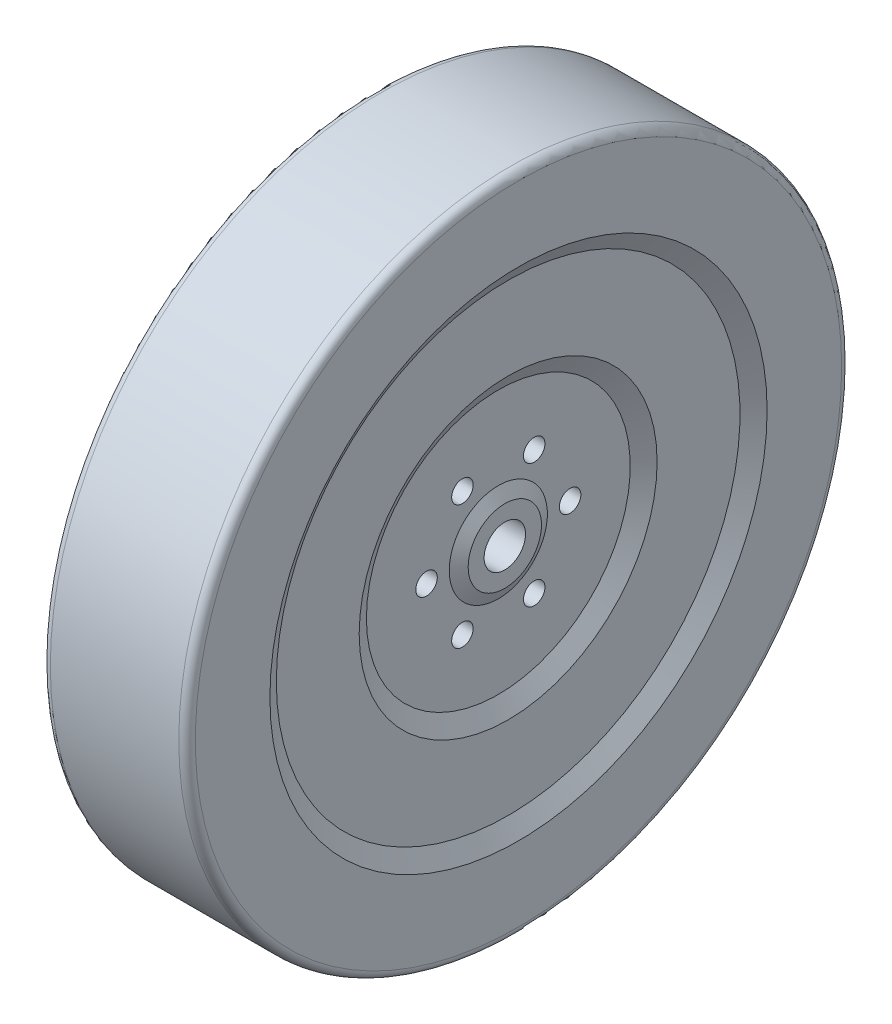
ISO-10303-21;
HEADER;
FILE_DESCRIPTION(('STEP AP214'),'2;1');
FILE_NAME('part.step','',(''),(''),'','','');
FILE_SCHEMA(('AUTOMOTIVE_DESIGN { 1 0 10303 214 1 1 1 1 }'));
ENDSEC;
DATA;
#1=APPLICATION_CONTEXT('core data for automotive mechanical design processes');
#2=APPLICATION_PROTOCOL_DEFINITION('international standard','automotive_design',2000,#1);
#3=PRODUCT_CONTEXT('',#1,'mechanical');
#4=PRODUCT('Part','Part','',(#3));
#5=PRODUCT_RELATED_PRODUCT_CATEGORY('part','',(#4));
#6=PRODUCT_DEFINITION_FORMATION('','',#4);
#7=PRODUCT_DEFINITION_CONTEXT('part definition',#1,'design');
#8=PRODUCT_DEFINITION('design','',#6,#7);
#9=PRODUCT_DEFINITION_SHAPE('','',#8);
#10=(LENGTH_UNIT() NAMED_UNIT(*) SI_UNIT(.MILLI.,.METRE.));
#11=(NAMED_UNIT(*) PLANE_ANGLE_UNIT() SI_UNIT($,.RADIAN.));
#12=(NAMED_UNIT(*) SI_UNIT($,.STERADIAN.) SOLID_ANGLE_UNIT());
#13=UNCERTAINTY_MEASURE_WITH_UNIT(LENGTH_MEASURE(1.E-05),#10,'distance_accuracy_value','');
#14=(GEOMETRIC_REPRESENTATION_CONTEXT(3) GLOBAL_UNCERTAINTY_ASSIGNED_CONTEXT((#13)) GLOBAL_UNIT_ASSIGNED_CONTEXT((#10,
#11,#12)) REPRESENTATION_CONTEXT('',''));
#15=CARTESIAN_POINT('',(0.,0.,0.));
#16=DIRECTION('',(0.,0.,1.));
#17=DIRECTION('',(1.,0.,0.));
#18=AXIS2_PLACEMENT_3D('',#15,#16,#17);
#19=CARTESIAN_POINT('',(0.,0.,0.));
#20=DIRECTION('',(-1.,0.,0.));
#21=DIRECTION('',(0.,0.,1.));
#22=AXIS2_PLACEMENT_3D('',#19,#20,#21);
#23=CYLINDRICAL_SURFACE('',#22,101.6);
#24=CARTESIAN_POINT('',(-19.685,0.,0.));
#25=DIRECTION('',(-1.,0.,0.));
#26=DIRECTION('',(0.,0.,1.));
#27=AXIS2_PLACEMENT_3D('',#24,#25,#26);
#28=CIRCLE('',#27,101.6);
#29=CARTESIAN_POINT('',(-19.685,0.,101.6));
#30=VERTEX_POINT('',#29);
#31=EDGE_CURVE('E40',#30,#30,#28,.F.);
#32=ORIENTED_EDGE('',*,*,#31,.T.);
#33=EDGE_LOOP('',(#32));
#34=FACE_BOUND('',#33,.T.);
#35=CARTESIAN_POINT('',(19.685,0.,0.));
#36=DIRECTION('',(1.,0.,0.));
#37=DIRECTION('',(0.,0.,-1.));
#38=AXIS2_PLACEMENT_3D('',#35,#36,#37);
#39=CIRCLE('',#38,101.6);
#40=CARTESIAN_POINT('',(19.685,0.,-101.6));
#41=VERTEX_POINT('',#40);
#42=EDGE_CURVE('E44',#41,#41,#39,.F.);
#43=ORIENTED_EDGE('',*,*,#42,.T.);
#44=EDGE_LOOP('',(#43));
#45=FACE_BOUND('',#44,.T.);
#46=ADVANCED_FACE('F33',(#34,#45),#23,.T.);
#47=CARTESIAN_POINT('',(-22.225,0.,101.6));
#48=DIRECTION('',(-1.,0.,0.));
#49=DIRECTION('',(0.,0.,1.));
#50=AXIS2_PLACEMENT_3D('',#47,#48,#49);
#51=PLANE('',#50);
#52=CARTESIAN_POINT('',(-22.225,0.,0.));
#53=DIRECTION('',(-1.,0.,0.));
#54=DIRECTION('',(0.,0.,1.));
#55=AXIS2_PLACEMENT_3D('',#52,#53,#54);
#56=CIRCLE('',#55,99.06);
#57=CARTESIAN_POINT('',(-22.225,0.,99.06));
#58=VERTEX_POINT('',#57);
#59=EDGE_CURVE('E48',#58,#58,#56,.T.);
#60=ORIENTED_EDGE('',*,*,#59,.T.);
#61=EDGE_LOOP('',(#60));
#62=FACE_BOUND('',#61,.T.);
#63=CARTESIAN_POINT('',(-22.225,0.,0.));
#64=DIRECTION('',(-1.,0.,0.));
#65=DIRECTION('',(0.,0.,1.));
#66=AXIS2_PLACEMENT_3D('',#63,#64,#65);
#67=CIRCLE('',#66,76.2);
#68=CARTESIAN_POINT('',(-22.225,0.,76.2));
#69=VERTEX_POINT('',#68);
#70=EDGE_CURVE('E53',#69,#69,#67,.T.);
#71=ORIENTED_EDGE('',*,*,#70,.F.);
#72=EDGE_LOOP('',(#71));
#73=FACE_BOUND('',#72,.T.);
#74=ADVANCED_FACE('F184',(#62,#73),#51,.T.);
#75=CARTESIAN_POINT('',(-19.05,0.,0.));
#76=DIRECTION('',(-1.,0.,0.));
#77=DIRECTION('',(0.,0.,1.));
#78=AXIS2_PLACEMENT_3D('',#75,#76,#77);
#79=CONICAL_SURFACE('',#78,71.0633652356277,1.01716771608131);
#80=ORIENTED_EDGE('',*,*,#70,.T.);
#81=EDGE_LOOP('',(#80));
#82=FACE_BOUND('',#81,.T.);
#83=CARTESIAN_POINT('',(-19.05,0.,0.));
#84=DIRECTION('',(-1.,0.,0.));
#85=DIRECTION('',(0.,0.,1.));
#86=AXIS2_PLACEMENT_3D('',#83,#84,#85);
#87=CIRCLE('',#86,71.0633652356277);
#88=CARTESIAN_POINT('',(-19.05,0.,71.0633652356277));
#89=VERTEX_POINT('',#88);
#90=EDGE_CURVE('E56',#89,#89,#87,.T.);
#91=ORIENTED_EDGE('',*,*,#90,.F.);
#92=EDGE_LOOP('',(#91));
#93=FACE_BOUND('',#92,.T.);
#94=ADVANCED_FACE('F189',(#82,#93),#79,.F.);
#95=CARTESIAN_POINT('',(-19.05,0.,71.0633652356277));
#96=DIRECTION('',(-1.,0.,0.));
#97=DIRECTION('',(0.,0.,1.));
#98=AXIS2_PLACEMENT_3D('',#95,#96,#97);
#99=PLANE('',#98);
#100=ORIENTED_EDGE('',*,*,#90,.T.);
#101=EDGE_LOOP('',(#100));
#102=FACE_BOUND('',#101,.T.);
#103=CARTESIAN_POINT('',(-19.05,0.,0.));
#104=DIRECTION('',(-1.,0.,0.));
#105=DIRECTION('',(0.,0.,1.));
#106=AXIS2_PLACEMENT_3D('',#103,#104,#105);
#107=CIRCLE('',#106,45.6633652356277);
#108=CARTESIAN_POINT('',(-19.05,0.,45.6633652356277));
#109=VERTEX_POINT('',#108);
#110=EDGE_CURVE('E59',#109,#109,#107,.T.);
#111=ORIENTED_EDGE('',*,*,#110,.F.);
#112=EDGE_LOOP('',(#111));
#113=FACE_BOUND('',#112,.T.);
#114=ADVANCED_FACE('F211',(#102,#113),#99,.T.);
#115=CARTESIAN_POINT('',(-16.034,0.,0.));
#116=DIRECTION('',(-1.,0.,0.));
#117=DIRECTION('',(0.,0.,1.));
#118=AXIS2_PLACEMENT_3D('',#115,#116,#117);
#119=CONICAL_SURFACE('',#118,40.4395,1.0471975511966);
#120=ORIENTED_EDGE('',*,*,#110,.T.);
#121=EDGE_LOOP('',(#120));
#122=FACE_BOUND('',#121,.T.);
#123=CARTESIAN_POINT('',(-16.034,0.,0.));
#124=DIRECTION('',(-1.,0.,0.));
#125=DIRECTION('',(0.,0.,1.));
#126=AXIS2_PLACEMENT_3D('',#123,#124,#125);
#127=CIRCLE('',#126,40.4395);
#128=CARTESIAN_POINT('',(-16.034,0.,40.4395));
#129=VERTEX_POINT('',#128);
#130=EDGE_CURVE('E62',#129,#129,#127,.T.);
#131=ORIENTED_EDGE('',*,*,#130,.F.);
#132=EDGE_LOOP('',(#131));
#133=FACE_BOUND('',#132,.T.);
#134=ADVANCED_FACE('F216',(#122,#133),#119,.F.);
#135=CARTESIAN_POINT('',(-16.034,0.,40.4395));
#136=DIRECTION('',(-1.,0.,0.));
#137=DIRECTION('',(0.,0.,1.));
#138=AXIS2_PLACEMENT_3D('',#135,#136,#137);
#139=PLANE('',#138);
#140=CARTESIAN_POINT('',(-16.034,0.,-22.));
#141=DIRECTION('',(-1.,0.,0.));
#142=DIRECTION('',(0.,0.,1.));
#143=AXIS2_PLACEMENT_3D('',#140,#141,#142);
#144=CIRCLE('',#143,3.3);
#145=CARTESIAN_POINT('',(-16.034,0.,-18.7));
#146=VERTEX_POINT('',#145);
#147=EDGE_CURVE('E95',#146,#146,#144,.T.);
#148=ORIENTED_EDGE('',*,*,#147,.F.);
#149=EDGE_LOOP('',(#148));
#150=FACE_BOUND('',#149,.T.);
#151=CARTESIAN_POINT('',(-16.034,19.0525588832575,-11.0000000000002));
#152=DIRECTION('',(-1.,0.,0.));
#153=DIRECTION('',(0.,0.,1.));
#154=AXIS2_PLACEMENT_3D('',#151,#152,#153);
#155=CIRCLE('',#154,3.3);
#156=CARTESIAN_POINT('',(-16.034,19.0525588832575,-7.70000000000022));
#157=VERTEX_POINT('',#156);
#158=EDGE_CURVE('E98',#157,#157,#155,.T.);
#159=ORIENTED_EDGE('',*,*,#158,.F.);
#160=EDGE_LOOP('',(#159));
#161=FACE_BOUND('',#160,.T.);
#162=CARTESIAN_POINT('',(-16.034,19.0525588832577,10.9999999999998));
#163=DIRECTION('',(-1.,0.,0.));
#164=DIRECTION('',(0.,0.,1.));
#165=AXIS2_PLACEMENT_3D('',#162,#163,#164);
#166=CIRCLE('',#165,3.3);
#167=CARTESIAN_POINT('',(-16.034,19.0525588832577,14.2999999999998));
#168=VERTEX_POINT('',#167);
#169=EDGE_CURVE('E101',#168,#168,#166,.T.);
#170=ORIENTED_EDGE('',*,*,#169,.F.);
#171=EDGE_LOOP('',(#170));
#172=FACE_BOUND('',#171,.T.);
#173=CARTESIAN_POINT('',(-16.034,1.53625178909098E-13,22.));
#174=DIRECTION('',(-1.,0.,0.));
#175=DIRECTION('',(0.,0.,1.));
#176=AXIS2_PLACEMENT_3D('',#173,#174,#175);
#177=CIRCLE('',#176,3.3);
#178=CARTESIAN_POINT('',(-16.034,1.53625178909098E-13,25.3));
#179=VERTEX_POINT('',#178);
#180=EDGE_CURVE('E104',#179,#179,#177,.T.);
#181=ORIENTED_EDGE('',*,*,#180,.F.);
#182=EDGE_LOOP('',(#181));
#183=FACE_BOUND('',#182,.T.);
#184=CARTESIAN_POINT('',(-16.034,-19.0525588832576,11.0000000000001));
#185=DIRECTION('',(-1.,0.,0.));
#186=DIRECTION('',(0.,0.,1.));
#187=AXIS2_PLACEMENT_3D('',#184,#185,#186);
#188=CIRCLE('',#187,3.3);
#189=CARTESIAN_POINT('',(-16.034,-19.0525588832576,14.3000000000001));
#190=VERTEX_POINT('',#189);
#191=EDGE_CURVE('E107',#190,#190,#188,.T.);
#192=ORIENTED_EDGE('',*,*,#191,.F.);
#193=EDGE_LOOP('',(#192));
#194=FACE_BOUND('',#193,.T.);
#195=CARTESIAN_POINT('',(-16.034,-19.0525588832577,-11.));
#196=DIRECTION('',(-1.,0.,0.));
#197=DIRECTION('',(0.,0.,1.));
#198=AXIS2_PLACEMENT_3D('',#195,#196,#197);
#199=CIRCLE('',#198,3.3);
#200=CARTESIAN_POINT('',(-16.034,-19.0525588832577,-7.69999999999995));
#201=VERTEX_POINT('',#200);
#202=EDGE_CURVE('E110',#201,#201,#199,.T.);
#203=ORIENTED_EDGE('',*,*,#202,.F.);
#204=EDGE_LOOP('',(#203));
#205=FACE_BOUND('',#204,.T.);
#206=ORIENTED_EDGE('',*,*,#130,.T.);
#207=EDGE_LOOP('',(#206));
#208=FACE_BOUND('',#207,.T.);
#209=CARTESIAN_POINT('',(-16.034,0.,0.));
#210=DIRECTION('',(-1.,0.,0.));
#211=DIRECTION('',(0.,0.,1.));
#212=AXIS2_PLACEMENT_3D('',#209,#210,#211);
#213=CIRCLE('',#212,15.0395);
#214=CARTESIAN_POINT('',(-16.034,0.,15.0395));
#215=VERTEX_POINT('',#214);
#216=EDGE_CURVE('E65',#215,#215,#213,.T.);
#217=ORIENTED_EDGE('',*,*,#216,.F.);
#218=EDGE_LOOP('',(#217));
#219=FACE_BOUND('',#218,.T.);
#220=ADVANCED_FACE('F222',(#150,#161,#172,#183,#194,#205,#208,#219),#139,.T.);
#221=CARTESIAN_POINT('',(-18.034,0.,0.));
#222=DIRECTION('',(1.,0.,0.));
#223=DIRECTION('',(0.,0.,-1.));
#224=AXIS2_PLACEMENT_3D('',#221,#222,#223);
#225=CONICAL_SURFACE('',#224,11.2395,1.08631839775787);
#226=ORIENTED_EDGE('',*,*,#216,.T.);
#227=EDGE_LOOP('',(#226));
#228=FACE_BOUND('',#227,.T.);
#229=CARTESIAN_POINT('',(-18.034,0.,0.));
#230=DIRECTION('',(-1.,0.,0.));
#231=DIRECTION('',(0.,0.,1.));
#232=AXIS2_PLACEMENT_3D('',#229,#230,#231);
#233=CIRCLE('',#232,11.2395);
#234=CARTESIAN_POINT('',(-18.034,0.,11.2395));
#235=VERTEX_POINT('',#234);
#236=EDGE_CURVE('E68',#235,#235,#233,.T.);
#237=ORIENTED_EDGE('',*,*,#236,.F.);
#238=EDGE_LOOP('',(#237));
#239=FACE_BOUND('',#238,.T.);
#240=ADVANCED_FACE('F228',(#228,#239),#225,.T.);
#241=CARTESIAN_POINT('',(-18.034,0.,11.2395));
#242=DIRECTION('',(-1.,0.,0.));
#243=DIRECTION('',(0.,0.,1.));
#244=AXIS2_PLACEMENT_3D('',#241,#242,#243);
#245=PLANE('',#244);
#246=ORIENTED_EDGE('',*,*,#236,.T.);
#247=EDGE_LOOP('',(#246));
#248=FACE_BOUND('',#247,.T.);
#249=CARTESIAN_POINT('',(-18.034,0.,0.));
#250=DIRECTION('',(-1.,0.,0.));
#251=DIRECTION('',(0.,0.,1.));
#252=AXIS2_PLACEMENT_3D('',#249,#250,#251);
#253=CIRCLE('',#252,6.35);
#254=CARTESIAN_POINT('',(-18.034,0.,6.35));
#255=VERTEX_POINT('',#254);
#256=EDGE_CURVE('E71',#255,#255,#253,.T.);
#257=ORIENTED_EDGE('',*,*,#256,.F.);
#258=EDGE_LOOP('',(#257));
#259=FACE_BOUND('',#258,.T.);
#260=ADVANCED_FACE('F235',(#248,#259),#245,.T.);
#261=CARTESIAN_POINT('',(0.,0.,0.));
#262=DIRECTION('',(-1.,0.,0.));
#263=DIRECTION('',(0.,0.,1.));
#264=AXIS2_PLACEMENT_3D('',#261,#262,#263);
#265=CYLINDRICAL_SURFACE('',#264,6.35);
#266=ORIENTED_EDGE('',*,*,#256,.T.);
#267=EDGE_LOOP('',(#266));
#268=FACE_BOUND('',#267,.T.);
#269=CARTESIAN_POINT('',(18.034,0.,0.));
#270=DIRECTION('',(-1.,0.,0.));
#271=DIRECTION('',(0.,0.,1.));
#272=AXIS2_PLACEMENT_3D('',#269,#270,#271);
#273=CIRCLE('',#272,6.35);
#274=CARTESIAN_POINT('',(18.034,0.,6.35));
#275=VERTEX_POINT('',#274);
#276=EDGE_CURVE('E74',#275,#275,#273,.T.);
#277=ORIENTED_EDGE('',*,*,#276,.F.);
#278=EDGE_LOOP('',(#277));
#279=FACE_BOUND('',#278,.T.);
#280=ADVANCED_FACE('F241',(#268,#279),#265,.F.);
#281=CARTESIAN_POINT('',(18.034,0.,11.2395));
#282=DIRECTION('',(1.,0.,0.));
#283=DIRECTION('',(0.,0.,-1.));
#284=AXIS2_PLACEMENT_3D('',#281,#282,#283);
#285=PLANE('',#284);
#286=ORIENTED_EDGE('',*,*,#276,.T.);
#287=EDGE_LOOP('',(#286));
#288=FACE_BOUND('',#287,.T.);
#289=CARTESIAN_POINT('',(18.034,0.,0.));
#290=DIRECTION('',(-1.,0.,0.));
#291=DIRECTION('',(0.,0.,1.));
#292=AXIS2_PLACEMENT_3D('',#289,#290,#291);
#293=CIRCLE('',#292,11.2395);
#294=CARTESIAN_POINT('',(18.034,0.,11.2395));
#295=VERTEX_POINT('',#294);
#296=EDGE_CURVE('E77',#295,#295,#293,.T.);
#297=ORIENTED_EDGE('',*,*,#296,.F.);
#298=EDGE_LOOP('',(#297));
#299=FACE_BOUND('',#298,.T.);
#300=ADVANCED_FACE('F247',(#288,#299),#285,.T.);
#301=CARTESIAN_POINT('',(16.034,0.,0.));
#302=DIRECTION('',(-1.,0.,0.));
#303=DIRECTION('',(0.,0.,1.));
#304=AXIS2_PLACEMENT_3D('',#301,#302,#303);
#305=CONICAL_SURFACE('',#304,15.0395,1.08631839775787);
#306=ORIENTED_EDGE('',*,*,#296,.T.);
#307=EDGE_LOOP('',(#306));
#308=FACE_BOUND('',#307,.T.);
#309=CARTESIAN_POINT('',(16.034,0.,0.));
#310=DIRECTION('',(-1.,0.,0.));
#311=DIRECTION('',(0.,0.,1.));
#312=AXIS2_PLACEMENT_3D('',#309,#310,#311);
#313=CIRCLE('',#312,15.0395);
#314=CARTESIAN_POINT('',(16.034,0.,15.0395));
#315=VERTEX_POINT('',#314);
#316=EDGE_CURVE('E80',#315,#315,#313,.T.);
#317=ORIENTED_EDGE('',*,*,#316,.F.);
#318=EDGE_LOOP('',(#317));
#319=FACE_BOUND('',#318,.T.);
#320=ADVANCED_FACE('F138',(#308,#319),#305,.T.);
#321=CARTESIAN_POINT('',(16.034,0.,40.4395));
#322=DIRECTION('',(1.,0.,0.));
#323=DIRECTION('',(0.,0.,-1.));
#324=AXIS2_PLACEMENT_3D('',#321,#322,#323);
#325=PLANE('',#324);
#326=CARTESIAN_POINT('',(16.034,0.,-22.));
#327=DIRECTION('',(1.,0.,0.));
#328=DIRECTION('',(0.,0.,-1.));
#329=AXIS2_PLACEMENT_3D('',#326,#327,#328);
#330=CIRCLE('',#329,3.3);
#331=CARTESIAN_POINT('',(16.034,0.,-25.3));
#332=VERTEX_POINT('',#331);
#333=EDGE_CURVE('E113',#332,#332,#330,.T.);
#334=ORIENTED_EDGE('',*,*,#333,.F.);
#335=EDGE_LOOP('',(#334));
#336=FACE_BOUND('',#335,.T.);
#337=CARTESIAN_POINT('',(16.034,19.0525588832575,-11.0000000000002));
#338=DIRECTION('',(1.,0.,0.));
#339=DIRECTION('',(0.,0.,-1.));
#340=AXIS2_PLACEMENT_3D('',#337,#338,#339);
#341=CIRCLE('',#340,3.3);
#342=CARTESIAN_POINT('',(16.034,19.0525588832575,-14.3000000000002));
#343=VERTEX_POINT('',#342);
#344=EDGE_CURVE('E118',#343,#343,#341,.T.);
#345=ORIENTED_EDGE('',*,*,#344,.F.);
#346=EDGE_LOOP('',(#345));
#347=FACE_BOUND('',#346,.T.);
#348=CARTESIAN_POINT('',(16.034,19.0525588832577,10.9999999999998));
#349=DIRECTION('',(1.,0.,0.));
#350=DIRECTION('',(0.,0.,-1.));
#351=AXIS2_PLACEMENT_3D('',#348,#349,#350);
#352=CIRCLE('',#351,3.3);
#353=CARTESIAN_POINT('',(16.034,19.0525588832577,7.69999999999982));
#354=VERTEX_POINT('',#353);
#355=EDGE_CURVE('E114',#354,#354,#352,.T.);
#356=ORIENTED_EDGE('',*,*,#355,.F.);
#357=EDGE_LOOP('',(#356));
#358=FACE_BOUND('',#357,.T.);
#359=CARTESIAN_POINT('',(16.034,1.53625178909098E-13,22.));
#360=DIRECTION('',(1.,0.,0.));
#361=DIRECTION('',(0.,0.,-1.));
#362=AXIS2_PLACEMENT_3D('',#359,#360,#361);
#363=CIRCLE('',#362,3.3);
#364=CARTESIAN_POINT('',(16.034,1.53625178909098E-13,18.7));
#365=VERTEX_POINT('',#364);
#366=EDGE_CURVE('E117',#365,#365,#363,.T.);
#367=ORIENTED_EDGE('',*,*,#366,.F.);
#368=EDGE_LOOP('',(#367));
#369=FACE_BOUND('',#368,.T.);
#370=CARTESIAN_POINT('',(16.034,-19.0525588832576,11.0000000000001));
#371=DIRECTION('',(1.,0.,0.));
#372=DIRECTION('',(0.,0.,-1.));
#373=AXIS2_PLACEMENT_3D('',#370,#371,#372);
#374=CIRCLE('',#373,3.3);
#375=CARTESIAN_POINT('',(16.034,-19.0525588832576,7.70000000000009));
#376=VERTEX_POINT('',#375);
#377=EDGE_CURVE('E121',#376,#376,#374,.T.);
#378=ORIENTED_EDGE('',*,*,#377,.F.);
#379=EDGE_LOOP('',(#378));
#380=FACE_BOUND('',#379,.T.);
#381=CARTESIAN_POINT('',(16.034,-19.0525588832577,-11.));
#382=DIRECTION('',(1.,0.,0.));
#383=DIRECTION('',(0.,0.,-1.));
#384=AXIS2_PLACEMENT_3D('',#381,#382,#383);
#385=CIRCLE('',#384,3.3);
#386=CARTESIAN_POINT('',(16.034,-19.0525588832577,-14.3));
#387=VERTEX_POINT('',#386);
#388=EDGE_CURVE('E124',#387,#387,#385,.T.);
#389=ORIENTED_EDGE('',*,*,#388,.F.);
#390=EDGE_LOOP('',(#389));
#391=FACE_BOUND('',#390,.T.);
#392=ORIENTED_EDGE('',*,*,#316,.T.);
#393=EDGE_LOOP('',(#392));
#394=FACE_BOUND('',#393,.T.);
#395=CARTESIAN_POINT('',(16.034,0.,0.));
#396=DIRECTION('',(-1.,0.,0.));
#397=DIRECTION('',(0.,0.,1.));
#398=AXIS2_PLACEMENT_3D('',#395,#396,#397);
#399=CIRCLE('',#398,40.4395);
#400=CARTESIAN_POINT('',(16.034,0.,40.4395));
#401=VERTEX_POINT('',#400);
#402=EDGE_CURVE('E83',#401,#401,#399,.T.);
#403=ORIENTED_EDGE('',*,*,#402,.F.);
#404=EDGE_LOOP('',(#403));
#405=FACE_BOUND('',#404,.T.);
#406=ADVANCED_FACE('F134',(#336,#347,#358,#369,#380,#391,#394,#405),#325,.T.);
#407=CARTESIAN_POINT('',(19.05,0.,0.));
#408=DIRECTION('',(1.,0.,0.));
#409=DIRECTION('',(0.,0.,-1.));
#410=AXIS2_PLACEMENT_3D('',#407,#408,#409);
#411=CONICAL_SURFACE('',#410,45.6633652356277,1.0471975511966);
#412=ORIENTED_EDGE('',*,*,#402,.T.);
#413=EDGE_LOOP('',(#412));
#414=FACE_BOUND('',#413,.T.);
#415=CARTESIAN_POINT('',(19.05,0.,0.));
#416=DIRECTION('',(-1.,0.,0.));
#417=DIRECTION('',(0.,0.,1.));
#418=AXIS2_PLACEMENT_3D('',#415,#416,#417);
#419=CIRCLE('',#418,45.6633652356277);
#420=CARTESIAN_POINT('',(19.05,0.,45.6633652356277));
#421=VERTEX_POINT('',#420);
#422=EDGE_CURVE('E86',#421,#421,#419,.T.);
#423=ORIENTED_EDGE('',*,*,#422,.F.);
#424=EDGE_LOOP('',(#423));
#425=FACE_BOUND('',#424,.T.);
#426=ADVANCED_FACE('F137',(#414,#425),#411,.F.);
#427=CARTESIAN_POINT('',(19.05,0.,71.0633652356277));
#428=DIRECTION('',(1.,0.,0.));
#429=DIRECTION('',(0.,0.,-1.));
#430=AXIS2_PLACEMENT_3D('',#427,#428,#429);
#431=PLANE('',#430);
#432=ORIENTED_EDGE('',*,*,#422,.T.);
#433=EDGE_LOOP('',(#432));
#434=FACE_BOUND('',#433,.T.);
#435=CARTESIAN_POINT('',(19.05,0.,0.));
#436=DIRECTION('',(-1.,0.,0.));
#437=DIRECTION('',(0.,0.,1.));
#438=AXIS2_PLACEMENT_3D('',#435,#436,#437);
#439=CIRCLE('',#438,71.0633652356277);
#440=CARTESIAN_POINT('',(19.05,0.,71.0633652356277));
#441=VERTEX_POINT('',#440);
#442=EDGE_CURVE('E89',#441,#441,#439,.T.);
#443=ORIENTED_EDGE('',*,*,#442,.F.);
#444=EDGE_LOOP('',(#443));
#445=FACE_BOUND('',#444,.T.);
#446=ADVANCED_FACE('F156',(#434,#445),#431,.T.);
#447=CARTESIAN_POINT('',(22.225,0.,0.));
#448=DIRECTION('',(1.,0.,0.));
#449=DIRECTION('',(0.,0.,-1.));
#450=AXIS2_PLACEMENT_3D('',#447,#448,#449);
#451=CONICAL_SURFACE('',#450,76.2,1.01716771608131);
#452=ORIENTED_EDGE('',*,*,#442,.T.);
#453=EDGE_LOOP('',(#452));
#454=FACE_BOUND('',#453,.T.);
#455=CARTESIAN_POINT('',(22.225,0.,0.));
#456=DIRECTION('',(-1.,0.,0.));
#457=DIRECTION('',(0.,0.,1.));
#458=AXIS2_PLACEMENT_3D('',#455,#456,#457);
#459=CIRCLE('',#458,76.2);
#460=CARTESIAN_POINT('',(22.225,0.,76.2));
#461=VERTEX_POINT('',#460);
#462=EDGE_CURVE('E92',#461,#461,#459,.T.);
#463=ORIENTED_EDGE('',*,*,#462,.F.);
#464=EDGE_LOOP('',(#463));
#465=FACE_BOUND('',#464,.T.);
#466=ADVANCED_FACE('F162',(#454,#465),#451,.F.);
#467=CARTESIAN_POINT('',(22.225,0.,101.6));
#468=DIRECTION('',(1.,0.,0.));
#469=DIRECTION('',(0.,0.,-1.));
#470=AXIS2_PLACEMENT_3D('',#467,#468,#469);
#471=PLANE('',#470);
#472=CARTESIAN_POINT('',(22.225,0.,0.));
#473=DIRECTION('',(1.,0.,0.));
#474=DIRECTION('',(0.,0.,-1.));
#475=AXIS2_PLACEMENT_3D('',#472,#473,#474);
#476=CIRCLE('',#475,99.06);
#477=CARTESIAN_POINT('',(22.225,0.,-99.06));
#478=VERTEX_POINT('',#477);
#479=EDGE_CURVE('E10',#478,#478,#476,.T.);
#480=ORIENTED_EDGE('',*,*,#479,.T.);
#481=EDGE_LOOP('',(#480));
#482=FACE_BOUND('',#481,.T.);
#483=ORIENTED_EDGE('',*,*,#462,.T.);
#484=EDGE_LOOP('',(#483));
#485=FACE_BOUND('',#484,.T.);
#486=ADVANCED_FACE('F168',(#482,#485),#471,.T.);
#487=CARTESIAN_POINT('',(-22.225,-19.0525588832577,-11.));
#488=DIRECTION('',(1.,0.,0.));
#489=DIRECTION('',(0.,0.,-1.));
#490=AXIS2_PLACEMENT_3D('',#487,#488,#489);
#491=CYLINDRICAL_SURFACE('',#490,3.3);
#492=ORIENTED_EDGE('',*,*,#202,.T.);
#493=EDGE_LOOP('',(#492));
#494=FACE_BOUND('',#493,.T.);
#495=ORIENTED_EDGE('',*,*,#388,.T.);
#496=EDGE_LOOP('',(#495));
#497=FACE_BOUND('',#496,.T.);
#498=ADVANCED_FACE('F173',(#494,#497),#491,.F.);
#499=CARTESIAN_POINT('',(-22.225,-19.0525588832576,11.0000000000001));
#500=DIRECTION('',(1.,0.,0.));
#501=DIRECTION('',(0.,0.,-1.));
#502=AXIS2_PLACEMENT_3D('',#499,#500,#501);
#503=CYLINDRICAL_SURFACE('',#502,3.3);
#504=ORIENTED_EDGE('',*,*,#191,.T.);
#505=EDGE_LOOP('',(#504));
#506=FACE_BOUND('',#505,.T.);
#507=ORIENTED_EDGE('',*,*,#377,.T.);
#508=EDGE_LOOP('',(#507));
#509=FACE_BOUND('',#508,.T.);
#510=ADVANCED_FACE('F180',(#506,#509),#503,.F.);
#511=CARTESIAN_POINT('',(-22.225,1.53625178909098E-13,22.));
#512=DIRECTION('',(1.,0.,0.));
#513=DIRECTION('',(0.,0.,-1.));
#514=AXIS2_PLACEMENT_3D('',#511,#512,#513);
#515=CYLINDRICAL_SURFACE('',#514,3.3);
#516=ORIENTED_EDGE('',*,*,#180,.T.);
#517=EDGE_LOOP('',(#516));
#518=FACE_BOUND('',#517,.T.);
#519=ORIENTED_EDGE('',*,*,#366,.T.);
#520=EDGE_LOOP('',(#519));
#521=FACE_BOUND('',#520,.T.);
#522=ADVANCED_FACE('F305',(#518,#521),#515,.F.);
#523=CARTESIAN_POINT('',(-22.225,19.0525588832577,10.9999999999998));
#524=DIRECTION('',(1.,0.,0.));
#525=DIRECTION('',(0.,0.,-1.));
#526=AXIS2_PLACEMENT_3D('',#523,#524,#525);
#527=CYLINDRICAL_SURFACE('',#526,3.3);
#528=ORIENTED_EDGE('',*,*,#169,.T.);
#529=EDGE_LOOP('',(#528));
#530=FACE_BOUND('',#529,.T.);
#531=ORIENTED_EDGE('',*,*,#355,.T.);
#532=EDGE_LOOP('',(#531));
#533=FACE_BOUND('',#532,.T.);
#534=ADVANCED_FACE('F313',(#530,#533),#527,.F.);
#535=CARTESIAN_POINT('',(-22.225,19.0525588832575,-11.0000000000002));
#536=DIRECTION('',(1.,0.,0.));
#537=DIRECTION('',(0.,0.,-1.));
#538=AXIS2_PLACEMENT_3D('',#535,#536,#537);
#539=CYLINDRICAL_SURFACE('',#538,3.3);
#540=ORIENTED_EDGE('',*,*,#158,.T.);
#541=EDGE_LOOP('',(#540));
#542=FACE_BOUND('',#541,.T.);
#543=ORIENTED_EDGE('',*,*,#344,.T.);
#544=EDGE_LOOP('',(#543));
#545=FACE_BOUND('',#544,.T.);
#546=ADVANCED_FACE('F201',(#542,#545),#539,.F.);
#547=CARTESIAN_POINT('',(-22.225,0.,-22.));
#548=DIRECTION('',(1.,0.,0.));
#549=DIRECTION('',(0.,0.,-1.));
#550=AXIS2_PLACEMENT_3D('',#547,#548,#549);
#551=CYLINDRICAL_SURFACE('',#550,3.3);
#552=ORIENTED_EDGE('',*,*,#147,.T.);
#553=EDGE_LOOP('',(#552));
#554=FACE_BOUND('',#553,.T.);
#555=ORIENTED_EDGE('',*,*,#333,.T.);
#556=EDGE_LOOP('',(#555));
#557=FACE_BOUND('',#556,.T.);
#558=ADVANCED_FACE('F132',(#554,#557),#551,.F.);
#559=CARTESIAN_POINT('',(-19.685,0.,0.));
#560=DIRECTION('',(-1.,0.,0.));
#561=DIRECTION('',(0.,0.,1.));
#562=AXIS2_PLACEMENT_3D('',#559,#560,#561);
#563=TOROIDAL_SURFACE('',#562,99.06,2.54);
#564=ORIENTED_EDGE('',*,*,#31,.F.);
#565=EDGE_LOOP('',(#564));
#566=FACE_BOUND('',#565,.T.);
#567=ORIENTED_EDGE('',*,*,#59,.F.);
#568=EDGE_LOOP('',(#567));
#569=FACE_BOUND('',#568,.T.);
#570=ADVANCED_FACE('F194',(#566,#569),#563,.T.);
#571=CARTESIAN_POINT('',(19.685,0.,0.));
#572=DIRECTION('',(1.,0.,0.));
#573=DIRECTION('',(0.,0.,-1.));
#574=AXIS2_PLACEMENT_3D('',#571,#572,#573);
#575=TOROIDAL_SURFACE('',#574,99.06,2.54);
#576=ORIENTED_EDGE('',*,*,#479,.F.);
#577=EDGE_LOOP('',(#576));
#578=FACE_BOUND('',#577,.T.);
#579=ORIENTED_EDGE('',*,*,#42,.F.);
#580=EDGE_LOOP('',(#579));
#581=FACE_BOUND('',#580,.T.);
#582=ADVANCED_FACE('F35',(#578,#581),#575,.T.);
#583=CLOSED_SHELL('',(#46,#74,#94,#114,#134,#220,#240,#260,#280,#300,#320,#406,#426,#446,#466,
#486,#498,#510,#522,#534,#546,#558,#570,#582));
#584=MANIFOLD_SOLID_BREP('B2',#583);
#585=ADVANCED_BREP_SHAPE_REPRESENTATION('',(#18,#584),#14);
#586=SHAPE_DEFINITION_REPRESENTATION(#9,#585);
ENDSEC;
END-ISO-10303-21;
